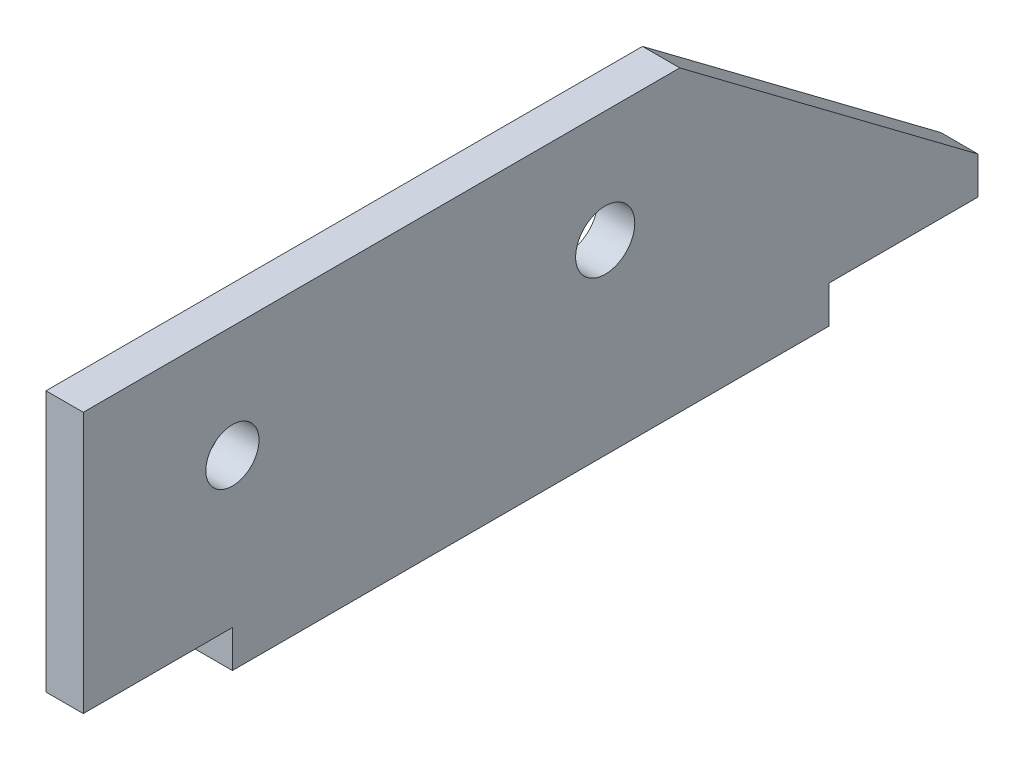
ISO-10303-21;
HEADER;
FILE_DESCRIPTION(('STEP AP214'),'2;1');
FILE_NAME('part.step','',(''),(''),'','','');
FILE_SCHEMA(('AUTOMOTIVE_DESIGN { 1 0 10303 214 1 1 1 1 }'));
ENDSEC;
DATA;
#1=APPLICATION_CONTEXT('core data for automotive mechanical design processes');
#2=APPLICATION_PROTOCOL_DEFINITION('international standard','automotive_design',2000,#1);
#3=PRODUCT_CONTEXT('',#1,'mechanical');
#4=PRODUCT('Part','Part','',(#3));
#5=PRODUCT_RELATED_PRODUCT_CATEGORY('part','',(#4));
#6=PRODUCT_DEFINITION_FORMATION('','',#4);
#7=PRODUCT_DEFINITION_CONTEXT('part definition',#1,'design');
#8=PRODUCT_DEFINITION('design','',#6,#7);
#9=PRODUCT_DEFINITION_SHAPE('','',#8);
#10=(LENGTH_UNIT() NAMED_UNIT(*) SI_UNIT(.MILLI.,.METRE.));
#11=(NAMED_UNIT(*) PLANE_ANGLE_UNIT() SI_UNIT($,.RADIAN.));
#12=(NAMED_UNIT(*) SI_UNIT($,.STERADIAN.) SOLID_ANGLE_UNIT());
#13=UNCERTAINTY_MEASURE_WITH_UNIT(LENGTH_MEASURE(1.E-05),#10,'distance_accuracy_value','');
#14=(GEOMETRIC_REPRESENTATION_CONTEXT(3) GLOBAL_UNCERTAINTY_ASSIGNED_CONTEXT((#13)) GLOBAL_UNIT_ASSIGNED_CONTEXT((#10,
#11,#12)) REPRESENTATION_CONTEXT('',''));
#15=CARTESIAN_POINT('',(0.,0.,0.));
#16=DIRECTION('',(0.,0.,1.));
#17=DIRECTION('',(1.,0.,0.));
#18=AXIS2_PLACEMENT_3D('',#15,#16,#17);
#19=CARTESIAN_POINT('',(3.175,0.,0.));
#20=DIRECTION('',(0.,0.,-1.));
#21=DIRECTION('',(-1.,0.,0.));
#22=AXIS2_PLACEMENT_3D('',#19,#20,#21);
#23=PLANE('',#22);
#24=DIRECTION('',(0.,-1.,0.));
#25=VECTOR('',#24,1.);
#26=CARTESIAN_POINT('',(0.,0.,0.));
#27=LINE('',#26,#25);
#28=CARTESIAN_POINT('',(0.,25.4,0.));
#29=VERTEX_POINT('',#28);
#30=CARTESIAN_POINT('',(0.,3.175,0.));
#31=VERTEX_POINT('',#30);
#32=EDGE_CURVE('E125',#29,#31,#27,.T.);
#33=ORIENTED_EDGE('',*,*,#32,.T.);
#34=DIRECTION('',(1.,0.,0.));
#35=VECTOR('',#34,1.);
#36=CARTESIAN_POINT('',(0.,3.175,0.));
#37=LINE('',#36,#35);
#38=CARTESIAN_POINT('',(3.175,3.175,0.));
#39=VERTEX_POINT('',#38);
#40=EDGE_CURVE('E156',#31,#39,#37,.T.);
#41=ORIENTED_EDGE('',*,*,#40,.T.);
#42=DIRECTION('',(0.,-1.,0.));
#43=VECTOR('',#42,1.);
#44=CARTESIAN_POINT('',(3.175,0.,0.));
#45=LINE('',#44,#43);
#46=CARTESIAN_POINT('',(3.175,25.4,0.));
#47=VERTEX_POINT('',#46);
#48=EDGE_CURVE('E137',#47,#39,#45,.T.);
#49=ORIENTED_EDGE('',*,*,#48,.F.);
#50=DIRECTION('',(-1.,0.,0.));
#51=VECTOR('',#50,1.);
#52=CARTESIAN_POINT('',(3.175,25.4,0.));
#53=LINE('',#52,#51);
#54=EDGE_CURVE('E138',#47,#29,#53,.T.);
#55=ORIENTED_EDGE('',*,*,#54,.T.);
#56=EDGE_LOOP('',(#33,#41,#49,#55));
#57=FACE_BOUND('',#56,.T.);
#58=ADVANCED_FACE('F33',(#57),#23,.F.);
#59=CARTESIAN_POINT('',(3.175,0.,0.));
#60=DIRECTION('',(0.,1.,0.));
#61=DIRECTION('',(0.,0.,1.));
#62=AXIS2_PLACEMENT_3D('',#59,#60,#61);
#63=PLANE('',#62);
#64=DIRECTION('',(0.,0.,-1.));
#65=VECTOR('',#64,1.);
#66=CARTESIAN_POINT('',(3.175,0.,0.));
#67=LINE('',#66,#65);
#68=CARTESIAN_POINT('',(3.175,0.,-12.7));
#69=VERTEX_POINT('',#68);
#70=CARTESIAN_POINT('',(3.175,0.,-63.5));
#71=VERTEX_POINT('',#70);
#72=EDGE_CURVE('E120',#69,#71,#67,.T.);
#73=ORIENTED_EDGE('',*,*,#72,.F.);
#74=DIRECTION('',(1.,0.,0.));
#75=VECTOR('',#74,1.);
#76=CARTESIAN_POINT('',(0.,0.,-12.7));
#77=LINE('',#76,#75);
#78=CARTESIAN_POINT('',(0.,0.,-12.7));
#79=VERTEX_POINT('',#78);
#80=EDGE_CURVE('E106',#79,#69,#77,.T.);
#81=ORIENTED_EDGE('',*,*,#80,.F.);
#82=DIRECTION('',(0.,0.,-1.));
#83=VECTOR('',#82,1.);
#84=CARTESIAN_POINT('',(0.,0.,0.));
#85=LINE('',#84,#83);
#86=CARTESIAN_POINT('',(0.,0.,-63.5));
#87=VERTEX_POINT('',#86);
#88=EDGE_CURVE('E118',#79,#87,#85,.T.);
#89=ORIENTED_EDGE('',*,*,#88,.T.);
#90=DIRECTION('',(1.,0.,0.));
#91=VECTOR('',#90,1.);
#92=CARTESIAN_POINT('',(0.,0.,-63.5));
#93=LINE('',#92,#91);
#94=EDGE_CURVE('E190',#87,#71,#93,.T.);
#95=ORIENTED_EDGE('',*,*,#94,.T.);
#96=EDGE_LOOP('',(#73,#81,#89,#95));
#97=FACE_BOUND('',#96,.T.);
#98=ADVANCED_FACE('F116',(#97),#63,.F.);
#99=CARTESIAN_POINT('',(3.175,6.35,-76.2));
#100=DIRECTION('',(0.,0.,1.));
#101=DIRECTION('',(1.,0.,0.));
#102=AXIS2_PLACEMENT_3D('',#99,#100,#101);
#103=PLANE('',#102);
#104=DIRECTION('',(0.,1.,0.));
#105=VECTOR('',#104,1.);
#106=CARTESIAN_POINT('',(3.175,6.35,-76.2));
#107=LINE('',#106,#105);
#108=CARTESIAN_POINT('',(3.175,3.175,-76.2));
#109=VERTEX_POINT('',#108);
#110=CARTESIAN_POINT('',(3.175,6.35,-76.2));
#111=VERTEX_POINT('',#110);
#112=EDGE_CURVE('E161',#109,#111,#107,.T.);
#113=ORIENTED_EDGE('',*,*,#112,.F.);
#114=DIRECTION('',(1.,0.,0.));
#115=VECTOR('',#114,1.);
#116=CARTESIAN_POINT('',(0.,3.175,-76.2));
#117=LINE('',#116,#115);
#118=CARTESIAN_POINT('',(0.,3.175,-76.2));
#119=VERTEX_POINT('',#118);
#120=EDGE_CURVE('E178',#119,#109,#117,.T.);
#121=ORIENTED_EDGE('',*,*,#120,.F.);
#122=DIRECTION('',(0.,1.,0.));
#123=VECTOR('',#122,1.);
#124=CARTESIAN_POINT('',(0.,6.35,-76.2));
#125=LINE('',#124,#123);
#126=CARTESIAN_POINT('',(0.,6.35,-76.2));
#127=VERTEX_POINT('',#126);
#128=EDGE_CURVE('E124',#119,#127,#125,.T.);
#129=ORIENTED_EDGE('',*,*,#128,.T.);
#130=DIRECTION('',(-1.,0.,0.));
#131=VECTOR('',#130,1.);
#132=CARTESIAN_POINT('',(3.175,6.35,-76.2));
#133=LINE('',#132,#131);
#134=EDGE_CURVE('E11',#111,#127,#133,.T.);
#135=ORIENTED_EDGE('',*,*,#134,.F.);
#136=EDGE_LOOP('',(#113,#121,#129,#135));
#137=FACE_BOUND('',#136,.T.);
#138=ADVANCED_FACE('F176',(#137),#103,.F.);
#139=CARTESIAN_POINT('',(3.175,25.4,-50.8));
#140=DIRECTION('',(0.,-0.8,0.6));
#141=DIRECTION('',(0.,-0.6,-0.8));
#142=AXIS2_PLACEMENT_3D('',#139,#140,#141);
#143=PLANE('',#142);
#144=DIRECTION('',(0.,0.6,0.8));
#145=VECTOR('',#144,1.);
#146=CARTESIAN_POINT('',(0.,25.4,-50.8));
#147=LINE('',#146,#145);
#148=CARTESIAN_POINT('',(0.,25.4,-50.8));
#149=VERTEX_POINT('',#148);
#150=EDGE_CURVE('E127',#127,#149,#147,.T.);
#151=ORIENTED_EDGE('',*,*,#150,.T.);
#152=DIRECTION('',(-1.,0.,0.));
#153=VECTOR('',#152,1.);
#154=CARTESIAN_POINT('',(3.175,25.4,-50.8));
#155=LINE('',#154,#153);
#156=CARTESIAN_POINT('',(3.175,25.4,-50.8));
#157=VERTEX_POINT('',#156);
#158=EDGE_CURVE('E40',#157,#149,#155,.T.);
#159=ORIENTED_EDGE('',*,*,#158,.F.);
#160=DIRECTION('',(0.,0.6,0.8));
#161=VECTOR('',#160,1.);
#162=CARTESIAN_POINT('',(3.175,25.4,-50.8));
#163=LINE('',#162,#161);
#164=EDGE_CURVE('E168',#111,#157,#163,.T.);
#165=ORIENTED_EDGE('',*,*,#164,.F.);
#166=ORIENTED_EDGE('',*,*,#134,.T.);
#167=EDGE_LOOP('',(#151,#159,#165,#166));
#168=FACE_BOUND('',#167,.T.);
#169=ADVANCED_FACE('F174',(#168),#143,.F.);
#170=CARTESIAN_POINT('',(3.175,25.4,-50.8));
#171=DIRECTION('',(0.,-1.,0.));
#172=DIRECTION('',(0.,0.,-1.));
#173=AXIS2_PLACEMENT_3D('',#170,#171,#172);
#174=PLANE('',#173);
#175=DIRECTION('',(0.,0.,1.));
#176=VECTOR('',#175,1.);
#177=CARTESIAN_POINT('',(0.,25.4,-50.8));
#178=LINE('',#177,#176);
#179=EDGE_CURVE('E135',#149,#29,#178,.T.);
#180=ORIENTED_EDGE('',*,*,#179,.T.);
#181=ORIENTED_EDGE('',*,*,#54,.F.);
#182=DIRECTION('',(0.,0.,1.));
#183=VECTOR('',#182,1.);
#184=CARTESIAN_POINT('',(3.175,25.4,-50.8));
#185=LINE('',#184,#183);
#186=EDGE_CURVE('E140',#157,#47,#185,.T.);
#187=ORIENTED_EDGE('',*,*,#186,.F.);
#188=ORIENTED_EDGE('',*,*,#158,.T.);
#189=EDGE_LOOP('',(#180,#181,#187,#188));
#190=FACE_BOUND('',#189,.T.);
#191=ADVANCED_FACE('F146',(#190),#174,.F.);
#192=CARTESIAN_POINT('',(3.175,0.,0.));
#193=DIRECTION('',(1.,0.,0.));
#194=DIRECTION('',(0.,0.,-1.));
#195=AXIS2_PLACEMENT_3D('',#192,#193,#194);
#196=PLANE('',#195);
#197=CARTESIAN_POINT('',(3.175,15.875,-44.45));
#198=DIRECTION('',(1.,0.,0.));
#199=DIRECTION('',(0.,0.,-1.));
#200=AXIS2_PLACEMENT_3D('',#197,#198,#199);
#201=CIRCLE('',#200,2.5193095432459);
#202=CARTESIAN_POINT('',(3.175,15.875,-46.9693095432459));
#203=VERTEX_POINT('',#202);
#204=EDGE_CURVE('E203',#203,#203,#201,.T.);
#205=ORIENTED_EDGE('',*,*,#204,.F.);
#206=EDGE_LOOP('',(#205));
#207=FACE_BOUND('',#206,.T.);
#208=DIRECTION('',(0.,0.,1.));
#209=VECTOR('',#208,1.);
#210=CARTESIAN_POINT('',(3.175,3.175,0.));
#211=LINE('',#210,#209);
#212=CARTESIAN_POINT('',(3.175,3.175,-12.7));
#213=VERTEX_POINT('',#212);
#214=EDGE_CURVE('E111',#213,#39,#211,.T.);
#215=ORIENTED_EDGE('',*,*,#214,.F.);
#216=DIRECTION('',(0.,1.,0.));
#217=VECTOR('',#216,1.);
#218=CARTESIAN_POINT('',(3.175,0.,-12.7));
#219=LINE('',#218,#217);
#220=EDGE_CURVE('E192',#69,#213,#219,.T.);
#221=ORIENTED_EDGE('',*,*,#220,.F.);
#222=ORIENTED_EDGE('',*,*,#72,.T.);
#223=DIRECTION('',(0.,-1.,0.));
#224=VECTOR('',#223,1.);
#225=CARTESIAN_POINT('',(3.175,0.,-63.5));
#226=LINE('',#225,#224);
#227=CARTESIAN_POINT('',(3.175,3.175,-63.5));
#228=VERTEX_POINT('',#227);
#229=EDGE_CURVE('E181',#228,#71,#226,.T.);
#230=ORIENTED_EDGE('',*,*,#229,.F.);
#231=DIRECTION('',(0.,0.,1.));
#232=VECTOR('',#231,1.);
#233=CARTESIAN_POINT('',(3.175,3.175,-76.2));
#234=LINE('',#233,#232);
#235=EDGE_CURVE('E184',#109,#228,#234,.T.);
#236=ORIENTED_EDGE('',*,*,#235,.F.);
#237=ORIENTED_EDGE('',*,*,#112,.T.);
#238=ORIENTED_EDGE('',*,*,#164,.T.);
#239=ORIENTED_EDGE('',*,*,#186,.T.);
#240=ORIENTED_EDGE('',*,*,#48,.T.);
#241=EDGE_LOOP('',(#215,#221,#222,#230,#236,#237,#238,#239,#240));
#242=FACE_BOUND('',#241,.T.);
#243=CARTESIAN_POINT('',(3.175,15.875,-12.7));
#244=DIRECTION('',(1.,0.,0.));
#245=DIRECTION('',(0.,0.,-1.));
#246=AXIS2_PLACEMENT_3D('',#243,#244,#245);
#247=CIRCLE('',#246,2.26466036125776);
#248=CARTESIAN_POINT('',(3.175,15.875,-14.9646603612578));
#249=VERTEX_POINT('',#248);
#250=EDGE_CURVE('E164',#249,#249,#247,.T.);
#251=ORIENTED_EDGE('',*,*,#250,.F.);
#252=EDGE_LOOP('',(#251));
#253=FACE_BOUND('',#252,.T.);
#254=ADVANCED_FACE('F169',(#207,#242,#253),#196,.T.);
#255=CARTESIAN_POINT('',(0.,0.,0.));
#256=DIRECTION('',(1.,0.,0.));
#257=DIRECTION('',(0.,0.,-1.));
#258=AXIS2_PLACEMENT_3D('',#255,#256,#257);
#259=PLANE('',#258);
#260=CARTESIAN_POINT('',(0.,15.875,-44.45));
#261=DIRECTION('',(1.,0.,0.));
#262=DIRECTION('',(0.,0.,-1.));
#263=AXIS2_PLACEMENT_3D('',#260,#261,#262);
#264=CIRCLE('',#263,2.5193095432459);
#265=CARTESIAN_POINT('',(0.,15.875,-46.9693095432459));
#266=VERTEX_POINT('',#265);
#267=EDGE_CURVE('E199',#266,#266,#264,.T.);
#268=ORIENTED_EDGE('',*,*,#267,.T.);
#269=EDGE_LOOP('',(#268));
#270=FACE_BOUND('',#269,.T.);
#271=CARTESIAN_POINT('',(0.,15.875,-12.7));
#272=DIRECTION('',(1.,0.,0.));
#273=DIRECTION('',(0.,0.,-1.));
#274=AXIS2_PLACEMENT_3D('',#271,#272,#273);
#275=CIRCLE('',#274,2.26466036125776);
#276=CARTESIAN_POINT('',(0.,15.875,-14.9646603612578));
#277=VERTEX_POINT('',#276);
#278=EDGE_CURVE('E130',#277,#277,#275,.T.);
#279=ORIENTED_EDGE('',*,*,#278,.T.);
#280=EDGE_LOOP('',(#279));
#281=FACE_BOUND('',#280,.T.);
#282=DIRECTION('',(0.,1.,0.));
#283=VECTOR('',#282,1.);
#284=CARTESIAN_POINT('',(0.,0.,-12.7));
#285=LINE('',#284,#283);
#286=CARTESIAN_POINT('',(0.,3.175,-12.7));
#287=VERTEX_POINT('',#286);
#288=EDGE_CURVE('E102',#79,#287,#285,.T.);
#289=ORIENTED_EDGE('',*,*,#288,.T.);
#290=DIRECTION('',(0.,0.,1.));
#291=VECTOR('',#290,1.);
#292=CARTESIAN_POINT('',(0.,3.175,0.));
#293=LINE('',#292,#291);
#294=EDGE_CURVE('E47',#287,#31,#293,.T.);
#295=ORIENTED_EDGE('',*,*,#294,.T.);
#296=ORIENTED_EDGE('',*,*,#32,.F.);
#297=ORIENTED_EDGE('',*,*,#179,.F.);
#298=ORIENTED_EDGE('',*,*,#150,.F.);
#299=ORIENTED_EDGE('',*,*,#128,.F.);
#300=DIRECTION('',(0.,0.,1.));
#301=VECTOR('',#300,1.);
#302=CARTESIAN_POINT('',(0.,3.175,-76.2));
#303=LINE('',#302,#301);
#304=CARTESIAN_POINT('',(0.,3.175,-63.5));
#305=VERTEX_POINT('',#304);
#306=EDGE_CURVE('E179',#119,#305,#303,.T.);
#307=ORIENTED_EDGE('',*,*,#306,.T.);
#308=DIRECTION('',(0.,-1.,0.));
#309=VECTOR('',#308,1.);
#310=CARTESIAN_POINT('',(0.,0.,-63.5));
#311=LINE('',#310,#309);
#312=EDGE_CURVE('E55',#305,#87,#311,.T.);
#313=ORIENTED_EDGE('',*,*,#312,.T.);
#314=ORIENTED_EDGE('',*,*,#88,.F.);
#315=EDGE_LOOP('',(#289,#295,#296,#297,#298,#299,#307,#313,#314));
#316=FACE_BOUND('',#315,.T.);
#317=ADVANCED_FACE('F122',(#270,#281,#316),#259,.F.);
#318=CARTESIAN_POINT('',(0.,15.875,-12.7));
#319=DIRECTION('',(1.,0.,0.));
#320=DIRECTION('',(0.,0.,-1.));
#321=AXIS2_PLACEMENT_3D('',#318,#319,#320);
#322=CYLINDRICAL_SURFACE('',#321,2.26466036125776);
#323=ORIENTED_EDGE('',*,*,#278,.F.);
#324=EDGE_LOOP('',(#323));
#325=FACE_BOUND('',#324,.T.);
#326=ORIENTED_EDGE('',*,*,#250,.T.);
#327=EDGE_LOOP('',(#326));
#328=FACE_BOUND('',#327,.T.);
#329=ADVANCED_FACE('F224',(#325,#328),#322,.F.);
#330=CARTESIAN_POINT('',(0.,0.,-63.5));
#331=DIRECTION('',(0.,0.,1.));
#332=DIRECTION('',(1.,0.,0.));
#333=AXIS2_PLACEMENT_3D('',#330,#331,#332);
#334=PLANE('',#333);
#335=ORIENTED_EDGE('',*,*,#229,.T.);
#336=ORIENTED_EDGE('',*,*,#94,.F.);
#337=ORIENTED_EDGE('',*,*,#312,.F.);
#338=DIRECTION('',(1.,0.,0.));
#339=VECTOR('',#338,1.);
#340=CARTESIAN_POINT('',(0.,3.175,-63.5));
#341=LINE('',#340,#339);
#342=EDGE_CURVE('E193',#305,#228,#341,.T.);
#343=ORIENTED_EDGE('',*,*,#342,.T.);
#344=EDGE_LOOP('',(#335,#336,#337,#343));
#345=FACE_BOUND('',#344,.T.);
#346=ADVANCED_FACE('F215',(#345),#334,.F.);
#347=CARTESIAN_POINT('',(0.,3.175,-76.2));
#348=DIRECTION('',(0.,1.,0.));
#349=DIRECTION('',(0.,0.,1.));
#350=AXIS2_PLACEMENT_3D('',#347,#348,#349);
#351=PLANE('',#350);
#352=ORIENTED_EDGE('',*,*,#235,.T.);
#353=ORIENTED_EDGE('',*,*,#342,.F.);
#354=ORIENTED_EDGE('',*,*,#306,.F.);
#355=ORIENTED_EDGE('',*,*,#120,.T.);
#356=EDGE_LOOP('',(#352,#353,#354,#355));
#357=FACE_BOUND('',#356,.T.);
#358=ADVANCED_FACE('F216',(#357),#351,.F.);
#359=CARTESIAN_POINT('',(0.,3.175,0.));
#360=DIRECTION('',(0.,1.,0.));
#361=DIRECTION('',(0.,0.,1.));
#362=AXIS2_PLACEMENT_3D('',#359,#360,#361);
#363=PLANE('',#362);
#364=ORIENTED_EDGE('',*,*,#214,.T.);
#365=ORIENTED_EDGE('',*,*,#40,.F.);
#366=ORIENTED_EDGE('',*,*,#294,.F.);
#367=DIRECTION('',(1.,0.,0.));
#368=VECTOR('',#367,1.);
#369=CARTESIAN_POINT('',(0.,3.175,-12.7));
#370=LINE('',#369,#368);
#371=EDGE_CURVE('E108',#287,#213,#370,.T.);
#372=ORIENTED_EDGE('',*,*,#371,.T.);
#373=EDGE_LOOP('',(#364,#365,#366,#372));
#374=FACE_BOUND('',#373,.T.);
#375=ADVANCED_FACE('F213',(#374),#363,.F.);
#376=CARTESIAN_POINT('',(0.,0.,-12.7));
#377=DIRECTION('',(0.,0.,-1.));
#378=DIRECTION('',(-1.,0.,0.));
#379=AXIS2_PLACEMENT_3D('',#376,#377,#378);
#380=PLANE('',#379);
#381=ORIENTED_EDGE('',*,*,#220,.T.);
#382=ORIENTED_EDGE('',*,*,#371,.F.);
#383=ORIENTED_EDGE('',*,*,#288,.F.);
#384=ORIENTED_EDGE('',*,*,#80,.T.);
#385=EDGE_LOOP('',(#381,#382,#383,#384));
#386=FACE_BOUND('',#385,.T.);
#387=ADVANCED_FACE('F105',(#386),#380,.F.);
#388=CARTESIAN_POINT('',(0.,15.875,-44.45));
#389=DIRECTION('',(1.,0.,0.));
#390=DIRECTION('',(0.,0.,-1.));
#391=AXIS2_PLACEMENT_3D('',#388,#389,#390);
#392=CYLINDRICAL_SURFACE('',#391,2.5193095432459);
#393=ORIENTED_EDGE('',*,*,#267,.F.);
#394=EDGE_LOOP('',(#393));
#395=FACE_BOUND('',#394,.T.);
#396=ORIENTED_EDGE('',*,*,#204,.T.);
#397=EDGE_LOOP('',(#396));
#398=FACE_BOUND('',#397,.T.);
#399=ADVANCED_FACE('F273',(#395,#398),#392,.F.);
#400=CLOSED_SHELL('',(#58,#98,#138,#169,#191,#254,#317,#329,#346,#358,#375,#387,#399));
#401=MANIFOLD_SOLID_BREP('B2',#400);
#402=ADVANCED_BREP_SHAPE_REPRESENTATION('',(#18,#401),#14);
#403=SHAPE_DEFINITION_REPRESENTATION(#9,#402);
ENDSEC;
END-ISO-10303-21;
